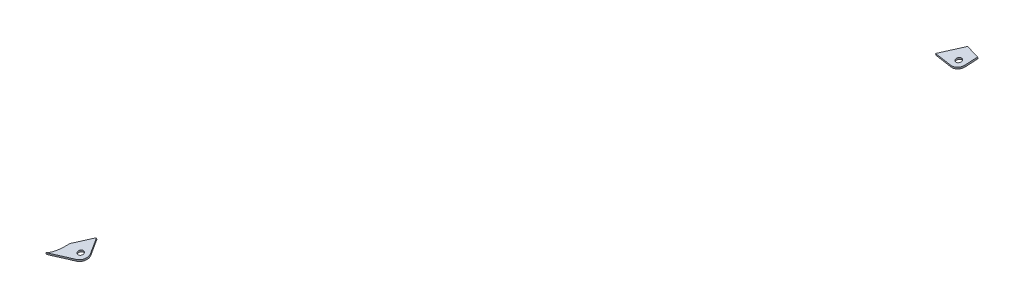
ISO-10303-21;
HEADER;
FILE_DESCRIPTION(('STEP AP214'),'2;1');
FILE_NAME('part.step','',(''),(''),'','','');
FILE_SCHEMA(('AUTOMOTIVE_DESIGN { 1 0 10303 214 1 1 1 1 }'));
ENDSEC;
DATA;
#1=APPLICATION_CONTEXT('core data for automotive mechanical design processes');
#2=APPLICATION_PROTOCOL_DEFINITION('international standard','automotive_design',2000,#1);
#3=PRODUCT_CONTEXT('',#1,'mechanical');
#4=PRODUCT('Part','Part','',(#3));
#5=PRODUCT_RELATED_PRODUCT_CATEGORY('part','',(#4));
#6=PRODUCT_DEFINITION_FORMATION('','',#4);
#7=PRODUCT_DEFINITION_CONTEXT('part definition',#1,'design');
#8=PRODUCT_DEFINITION('design','',#6,#7);
#9=PRODUCT_DEFINITION_SHAPE('','',#8);
#10=(LENGTH_UNIT() NAMED_UNIT(*) SI_UNIT(.MILLI.,.METRE.));
#11=(NAMED_UNIT(*) PLANE_ANGLE_UNIT() SI_UNIT($,.RADIAN.));
#12=(NAMED_UNIT(*) SI_UNIT($,.STERADIAN.) SOLID_ANGLE_UNIT());
#13=UNCERTAINTY_MEASURE_WITH_UNIT(LENGTH_MEASURE(1.E-05),#10,'distance_accuracy_value','');
#14=(GEOMETRIC_REPRESENTATION_CONTEXT(3) GLOBAL_UNCERTAINTY_ASSIGNED_CONTEXT((#13)) GLOBAL_UNIT_ASSIGNED_CONTEXT((#10,
#11,#12)) REPRESENTATION_CONTEXT('',''));
#15=CARTESIAN_POINT('',(0.,0.,0.));
#16=DIRECTION('',(0.,0.,1.));
#17=DIRECTION('',(1.,0.,0.));
#18=AXIS2_PLACEMENT_3D('',#15,#16,#17);
#19=CARTESIAN_POINT('',(1334.80841022403,286.948805486564,488.018057564818));
#20=CARTESIAN_POINT('',(1339.77571566488,288.27052628098,481.218393543914));
#21=CARTESIAN_POINT('',(1344.74018481782,289.591498692983,474.42257961676));
#22=CARTESIAN_POINT('',(1349.70180710941,290.911719908774,467.63063025909));
#23=(BOUNDED_CURVE() B_SPLINE_CURVE(3,(#19,#20,#21,#22),.UNSPECIFIED.,.F.,
.F.) B_SPLINE_CURVE_WITH_KNOTS((4,4),(0.963874291107527,1.),
.UNSPECIFIED.) CURVE() GEOMETRIC_REPRESENTATION_ITEM() RATIONAL_B_SPLINE_CURVE((0.999942294513788,
0.999960808747962,0.999980043910033,1.)) REPRESENTATION_ITEM(''));
#24=DIRECTION('',(0.,-0.981627183447661,-0.190808995376562));
#25=VECTOR('',#24,1.);
#26=SURFACE_OF_LINEAR_EXTRUSION('',#23,#25);
#27=CARTESIAN_POINT('',(1334.80841022403,284.985551119669,487.636439574065));
#28=CARTESIAN_POINT('',(1339.77571566488,286.307271914085,480.836775553161));
#29=CARTESIAN_POINT('',(1344.74018481782,287.628244326087,474.040961626007));
#30=CARTESIAN_POINT('',(1349.70180710941,288.948465541879,467.249012268337));
#31=(BOUNDED_CURVE() B_SPLINE_CURVE(3,(#27,#28,#29,#30),.UNSPECIFIED.,.F.,
.F.) B_SPLINE_CURVE_WITH_KNOTS((4,4),(0.963874291107527,1.),
.UNSPECIFIED.) CURVE() GEOMETRIC_REPRESENTATION_ITEM() RATIONAL_B_SPLINE_CURVE((0.999942294513788,
0.999960808747962,0.999980043910033,1.)) REPRESENTATION_ITEM(''));
#32=CARTESIAN_POINT('',(1334.80841022403,284.985551119669,487.636439574065));
#33=VERTEX_POINT('',#32);
#34=CARTESIAN_POINT('',(1349.70180710889,288.948465541898,467.249012268237));
#35=VERTEX_POINT('',#34);
#36=EDGE_CURVE('E124',#33,#35,#31,.T.);
#37=ORIENTED_EDGE('',*,*,#36,.F.);
#38=DIRECTION('',(0.,-0.981627183447661,-0.190808995376562));
#39=VECTOR('',#38,1.);
#40=CARTESIAN_POINT('',(1334.80841022403,286.948805486564,488.018057564818));
#41=LINE('',#40,#39);
#42=CARTESIAN_POINT('',(1334.80841022403,286.948805486564,488.018057564818));
#43=VERTEX_POINT('',#42);
#44=EDGE_CURVE('E12',#43,#33,#41,.T.);
#45=ORIENTED_EDGE('',*,*,#44,.F.);
#46=CARTESIAN_POINT('',(1349.70180710889,290.911719908794,467.63063025899));
#47=VERTEX_POINT('',#46);
#48=EDGE_CURVE('E117',#43,#47,#23,.T.);
#49=ORIENTED_EDGE('',*,*,#48,.T.);
#50=DIRECTION('',(0.,-0.981627183447661,-0.190808995376562));
#51=VECTOR('',#50,1.);
#52=CARTESIAN_POINT('',(1349.70180710889,290.911719908794,467.63063025899));
#53=LINE('',#52,#51);
#54=EDGE_CURVE('E48',#47,#35,#53,.T.);
#55=ORIENTED_EDGE('',*,*,#54,.T.);
#56=EDGE_LOOP('',(#37,#45,#49,#55));
#57=FACE_BOUND('',#56,.T.);
#58=ADVANCED_FACE('F44',(#57),#26,.T.);
#59=CARTESIAN_POINT('',(1353.96749539418,286.478008377176,490.440098724625));
#60=DIRECTION('',(-0.127728639493142,-0.189246107962099,0.97358682472311));
#61=DIRECTION('',(0.,-0.981627183447662,-0.190808995376555));
#62=AXIS2_PLACEMENT_3D('',#59,#60,#61);
#63=PLANE('',#62);
#64=DIRECTION('',(-0.991809152333871,0.0243717733825484,-0.125381904631246));
#65=VECTOR('',#64,1.);
#66=CARTESIAN_POINT('',(1353.96749539418,284.51475401028,490.058480733872));
#67=LINE('',#66,#65);
#68=CARTESIAN_POINT('',(1353.96749539418,284.51475401028,490.058480733872));
#69=VERTEX_POINT('',#68);
#70=EDGE_CURVE('E144',#69,#33,#67,.T.);
#71=ORIENTED_EDGE('',*,*,#70,.F.);
#72=DIRECTION('',(0.,-0.981627183447661,-0.190808995376562));
#73=VECTOR('',#72,1.);
#74=CARTESIAN_POINT('',(1353.96749539418,286.478008377176,490.440098724625));
#75=LINE('',#74,#73);
#76=CARTESIAN_POINT('',(1353.96749539418,286.478008377176,490.440098724625));
#77=VERTEX_POINT('',#76);
#78=EDGE_CURVE('E54',#77,#69,#75,.T.);
#79=ORIENTED_EDGE('',*,*,#78,.F.);
#80=DIRECTION('',(-0.991809152333871,0.0243717733825484,-0.125381904631246));
#81=VECTOR('',#80,1.);
#82=CARTESIAN_POINT('',(1353.96749539418,286.478008377176,490.440098724625));
#83=LINE('',#82,#81);
#84=EDGE_CURVE('E112',#77,#43,#83,.T.);
#85=ORIENTED_EDGE('',*,*,#84,.T.);
#86=ORIENTED_EDGE('',*,*,#44,.T.);
#87=EDGE_LOOP('',(#71,#79,#85,#86));
#88=FACE_BOUND('',#87,.T.);
#89=ADVANCED_FACE('F150',(#88),#63,.T.);
#90=CARTESIAN_POINT('',(1354.98932451013,287.991977240873,482.651404126841));
#91=DIRECTION('',(0.,-0.981627183447661,-0.190808995376562));
#92=DIRECTION('',(0.,0.190808995376562,-0.981627183447661));
#93=AXIS2_PLACEMENT_3D('',#90,#91,#92);
#94=CYLINDRICAL_SURFACE('',#93,7.99999999999988);
#95=CARTESIAN_POINT('',(1354.98932451013,286.028722873977,482.269786136087));
#96=DIRECTION('',(0.,-0.981627183447661,-0.190808995376562));
#97=DIRECTION('',(0.,0.190808995376562,-0.981627183447661));
#98=AXIS2_PLACEMENT_3D('',#95,#96,#97);
#99=CIRCLE('',#98,7.99999999999988);
#100=CARTESIAN_POINT('',(1362.92379772879,285.833748686907,483.272841373185));
#101=VERTEX_POINT('',#100);
#102=EDGE_CURVE('E101',#101,#69,#99,.T.);
#103=ORIENTED_EDGE('',*,*,#102,.F.);
#104=DIRECTION('',(0.,-0.981627183447661,-0.190808995376562));
#105=VECTOR('',#104,1.);
#106=CARTESIAN_POINT('',(1362.92379772879,287.797003053803,483.654459363938));
#107=LINE('',#106,#105);
#108=CARTESIAN_POINT('',(1362.92379772879,287.797003053803,483.654459363938));
#109=VERTEX_POINT('',#108);
#110=EDGE_CURVE('E96',#109,#101,#107,.T.);
#111=ORIENTED_EDGE('',*,*,#110,.F.);
#112=CARTESIAN_POINT('',(1354.98932451013,287.991977240873,482.651404126841));
#113=DIRECTION('',(0.,-0.981627183447661,-0.190808995376562));
#114=DIRECTION('',(0.,0.190808995376562,-0.981627183447661));
#115=AXIS2_PLACEMENT_3D('',#112,#113,#114);
#116=CIRCLE('',#115,7.99999999999988);
#117=EDGE_CURVE('E99',#109,#77,#116,.T.);
#118=ORIENTED_EDGE('',*,*,#117,.T.);
#119=ORIENTED_EDGE('',*,*,#78,.T.);
#120=EDGE_LOOP('',(#103,#111,#118,#119));
#121=FACE_BOUND('',#120,.T.);
#122=ADVANCED_FACE('F98',(#121),#94,.T.);
#123=CARTESIAN_POINT('',(1362.92379772879,287.797003053803,483.654459363938));
#124=DIRECTION('',(0.991809152333083,-0.0243717733837169,0.12538190463725));
#125=DIRECTION('',(0.125419158615366,0.,-0.992103842675863));
#126=AXIS2_PLACEMENT_3D('',#123,#124,#125);
#127=PLANE('',#126);
#128=DIRECTION('',(-0.12772863949926,-0.189246107961948,0.973586824722337));
#129=VECTOR('',#128,1.);
#130=CARTESIAN_POINT('',(1362.92379772879,285.833748686907,483.272841373185));
#131=LINE('',#130,#129);
#132=CARTESIAN_POINT('',(1364.53800027905,288.22539359362,470.968894963586));
#133=VERTEX_POINT('',#132);
#134=EDGE_CURVE('E138',#133,#101,#131,.T.);
#135=ORIENTED_EDGE('',*,*,#134,.F.);
#136=DIRECTION('',(0.,-0.981627183447661,-0.190808995376562));
#137=VECTOR('',#136,1.);
#138=CARTESIAN_POINT('',(1364.53800027905,290.188647960515,471.350512954339));
#139=LINE('',#138,#137);
#140=CARTESIAN_POINT('',(1364.53800027905,290.188647960515,471.350512954339));
#141=VERTEX_POINT('',#140);
#142=EDGE_CURVE('E106',#141,#133,#139,.T.);
#143=ORIENTED_EDGE('',*,*,#142,.F.);
#144=DIRECTION('',(-0.12772863949926,-0.189246107961948,0.973586824722337));
#145=VECTOR('',#144,1.);
#146=CARTESIAN_POINT('',(1362.92379772879,287.797003053803,483.654459363938));
#147=LINE('',#146,#145);
#148=EDGE_CURVE('E111',#141,#109,#147,.T.);
#149=ORIENTED_EDGE('',*,*,#148,.T.);
#150=ORIENTED_EDGE('',*,*,#110,.T.);
#151=EDGE_LOOP('',(#135,#143,#149,#150));
#152=FACE_BOUND('',#151,.T.);
#153=ADVANCED_FACE('F114',(#152),#127,.T.);
#154=CARTESIAN_POINT('',(1349.70180710889,290.911719908794,467.63063025899));
#155=CARTESIAN_POINT('',(1355.02305477019,290.632243914892,469.06840960578));
#156=CARTESIAN_POINT('',(1359.97623471952,290.391577366024,470.306531666271));
#157=CARTESIAN_POINT('',(1364.53800027905,290.188647960515,471.350512954339));
#158=(BOUNDED_CURVE() B_SPLINE_CURVE(3,(#154,#155,#156,#157),.UNSPECIFIED.,.F.,
.F.) B_SPLINE_CURVE_WITH_KNOTS((4,4),(0.941558542295028,0.993310920669176),
.UNSPECIFIED.) CURVE() GEOMETRIC_REPRESENTATION_ITEM() RATIONAL_B_SPLINE_CURVE((0.88092624518701,
0.911422555321268,0.946038380466901,0.984773720623911)) REPRESENTATION_ITEM(''));
#159=DIRECTION('',(0.,-0.981627183447661,-0.190808995376562));
#160=VECTOR('',#159,1.);
#161=SURFACE_OF_LINEAR_EXTRUSION('',#158,#160);
#162=CARTESIAN_POINT('',(1349.70180710889,288.948465541898,467.249012268237));
#163=CARTESIAN_POINT('',(1355.02305477019,288.668989547997,468.686791615027));
#164=CARTESIAN_POINT('',(1359.97623471952,288.428322999128,469.924913675518));
#165=CARTESIAN_POINT('',(1364.53800027905,288.22539359362,470.968894963586));
#166=(BOUNDED_CURVE() B_SPLINE_CURVE(3,(#162,#163,#164,#165),.UNSPECIFIED.,.F.,
.F.) B_SPLINE_CURVE_WITH_KNOTS((4,4),(0.941558542295028,0.993310920669176),
.UNSPECIFIED.) CURVE() GEOMETRIC_REPRESENTATION_ITEM() RATIONAL_B_SPLINE_CURVE((0.88092624518701,
0.911422555321268,0.946038380466901,0.984773720623911)) REPRESENTATION_ITEM(''));
#167=EDGE_CURVE('E129',#35,#133,#166,.T.);
#168=ORIENTED_EDGE('',*,*,#167,.F.);
#169=ORIENTED_EDGE('',*,*,#54,.F.);
#170=EDGE_CURVE('E115',#47,#141,#158,.T.);
#171=ORIENTED_EDGE('',*,*,#170,.T.);
#172=ORIENTED_EDGE('',*,*,#142,.T.);
#173=EDGE_LOOP('',(#168,#169,#171,#172));
#174=FACE_BOUND('',#173,.T.);
#175=ADVANCED_FACE('F147',(#174),#161,.T.);
#176=CARTESIAN_POINT('',(1342.25731146865,288.930844096941,477.821352871996));
#177=DIRECTION('',(7.54046279953524E-09,-0.981627184479453,-0.190808990068451));
#178=DIRECTION('',(0.,0.190808990068451,-0.981627184479453));
#179=AXIS2_PLACEMENT_3D('',#176,#177,#178);
#180=PLANE('',#179);
#181=CARTESIAN_POINT('',(1354.98932451013,287.991977240873,482.651404126841));
#182=DIRECTION('',(0.,-0.981627183447661,-0.190808995376562));
#183=DIRECTION('',(0.,0.190808995376562,-0.981627183447661));
#184=AXIS2_PLACEMENT_3D('',#181,#182,#183);
#185=CIRCLE('',#184,2.99999999999994);
#186=CARTESIAN_POINT('',(1354.98932451013,288.564404227002,479.706522576498));
#187=VERTEX_POINT('',#186);
#188=EDGE_CURVE('E130',#187,#187,#185,.T.);
#189=ORIENTED_EDGE('',*,*,#188,.T.);
#190=EDGE_LOOP('',(#189));
#191=FACE_BOUND('',#190,.T.);
#192=ORIENTED_EDGE('',*,*,#48,.F.);
#193=ORIENTED_EDGE('',*,*,#84,.F.);
#194=ORIENTED_EDGE('',*,*,#117,.F.);
#195=ORIENTED_EDGE('',*,*,#148,.F.);
#196=ORIENTED_EDGE('',*,*,#170,.F.);
#197=EDGE_LOOP('',(#192,#193,#194,#195,#196));
#198=FACE_BOUND('',#197,.T.);
#199=ADVANCED_FACE('F110',(#191,#198),#180,.F.);
#200=CARTESIAN_POINT('',(1342.25731146865,286.967589730046,477.439734881243));
#201=DIRECTION('',(7.54046279953524E-09,-0.981627184479453,-0.190808990068451));
#202=DIRECTION('',(0.,0.190808990068451,-0.981627184479453));
#203=AXIS2_PLACEMENT_3D('',#200,#201,#202);
#204=PLANE('',#203);
#205=CARTESIAN_POINT('',(1354.98932451013,286.028722873977,482.269786136087));
#206=DIRECTION('',(0.,-0.981627183447661,-0.190808995376562));
#207=DIRECTION('',(0.,0.190808995376562,-0.981627183447661));
#208=AXIS2_PLACEMENT_3D('',#205,#206,#207);
#209=CIRCLE('',#208,2.99999999999994);
#210=CARTESIAN_POINT('',(1354.98932451013,286.601149860107,479.324904585744));
#211=VERTEX_POINT('',#210);
#212=EDGE_CURVE('E182',#211,#211,#209,.T.);
#213=ORIENTED_EDGE('',*,*,#212,.F.);
#214=EDGE_LOOP('',(#213));
#215=FACE_BOUND('',#214,.T.);
#216=ORIENTED_EDGE('',*,*,#36,.T.);
#217=ORIENTED_EDGE('',*,*,#167,.T.);
#218=ORIENTED_EDGE('',*,*,#134,.T.);
#219=ORIENTED_EDGE('',*,*,#102,.T.);
#220=ORIENTED_EDGE('',*,*,#70,.T.);
#221=EDGE_LOOP('',(#216,#217,#218,#219,#220));
#222=FACE_BOUND('',#221,.T.);
#223=ADVANCED_FACE('F149',(#215,#222),#204,.T.);
#224=CARTESIAN_POINT('',(1354.98932451013,287.991977240873,482.651404126841));
#225=DIRECTION('',(0.,-0.981627183447661,-0.190808995376562));
#226=DIRECTION('',(0.,0.190808995376562,-0.981627183447661));
#227=AXIS2_PLACEMENT_3D('',#224,#225,#226);
#228=CYLINDRICAL_SURFACE('',#227,2.99999999999994);
#229=ORIENTED_EDGE('',*,*,#188,.F.);
#230=EDGE_LOOP('',(#229));
#231=FACE_BOUND('',#230,.T.);
#232=ORIENTED_EDGE('',*,*,#212,.T.);
#233=EDGE_LOOP('',(#232));
#234=FACE_BOUND('',#233,.T.);
#235=ADVANCED_FACE('F170',(#231,#234),#228,.F.);
#236=CLOSED_SHELL('',(#58,#89,#122,#153,#175,#199,#223,#235));
#237=MANIFOLD_SOLID_BREP('B2',#236);
#238=CARTESIAN_POINT('',(923.569906868332,176.143738161114,1058.06071166388));
#239=CARTESIAN_POINT('',(923.978106770845,176.194725851389,1057.79840273711));
#240=CARTESIAN_POINT('',(924.361430621937,176.25237635367,1057.50181661408));
#241=CARTESIAN_POINT('',(924.933250586607,176.351512786669,1056.99180387957));
#242=CARTESIAN_POINT('',(925.135186128114,176.389480944466,1056.79647464089));
#243=CARTESIAN_POINT('',(925.521222500008,176.467380182454,1056.39571780326));
#244=CARTESIAN_POINT('',(925.706214443309,176.507458436446,1056.18953306073));
#245=CARTESIAN_POINT('',(926.596451968125,176.71273227506,1055.13349070992));
#246=CARTESIAN_POINT('',(927.201304914618,176.892533494042,1054.20849362673));
#247=CARTESIAN_POINT('',(928.265984348611,177.270510413532,1052.26397094762));
#248=CARTESIAN_POINT('',(928.714956528832,177.465090877904,1051.2629412382));
#249=CARTESIAN_POINT('',(929.501728033637,177.861708895427,1049.22251842335));
#250=CARTESIAN_POINT('',(929.83867607656,178.063803549593,1048.18283155865));
#251=CARTESIAN_POINT('',(930.429066466174,178.473594129809,1046.0746417835));
#252=CARTESIAN_POINT('',(930.682852112076,178.681957629435,1045.00270450472));
#253=CARTESIAN_POINT('',(931.173926629931,179.149466366922,1042.59758055177));
#254=CARTESIAN_POINT('',(931.393872962749,179.408729419647,1041.26378777269));
#255=CARTESIAN_POINT('',(931.575131617797,179.668330600665,1039.92825547433));
#256=B_SPLINE_CURVE_WITH_KNOTS('',3,(#238,#239,#240,#241,#242,#243,#244,#245,#246,#247,#248,
#249,#250,#251,#252,#253,#254,#255),.UNSPECIFIED.,.F.,.F.,(4,2,2,2,2,2,2,2,4),
(0.533256834167614,0.546875000000102,0.554687500000106,0.562500000000109,0.593750000000104,
0.625000000000098,0.656250000000093,0.687500000000087,0.726253317925459),.UNSPECIFIED.);
#257=DIRECTION('',(0.,-0.981627183447661,-0.190808995376562));
#258=VECTOR('',#257,1.);
#259=SURFACE_OF_LINEAR_EXTRUSION('',#256,#258);
#260=CARTESIAN_POINT('',(931.575131617797,177.70507623377,1039.54663748358));
#261=CARTESIAN_POINT('',(931.393872962749,177.445475052751,1040.88216978193));
#262=CARTESIAN_POINT('',(931.173926629931,177.186212000027,1042.21596256102));
#263=CARTESIAN_POINT('',(930.682852112076,176.718703262539,1044.62108651396));
#264=CARTESIAN_POINT('',(930.429066466174,176.510339762913,1045.69302379275));
#265=CARTESIAN_POINT('',(929.838676076559,176.100549182698,1047.8012135679));
#266=CARTESIAN_POINT('',(929.501728033637,175.898454528531,1048.8409004326));
#267=CARTESIAN_POINT('',(928.714956528832,175.501836511008,1050.88132324745));
#268=CARTESIAN_POINT('',(928.265984348611,175.307256046637,1051.88235295686));
#269=CARTESIAN_POINT('',(927.201304914618,174.929279127146,1053.82687563597));
#270=CARTESIAN_POINT('',(926.596451968125,174.749477908164,1054.75187271916));
#271=CARTESIAN_POINT('',(925.706214443309,174.54420406955,1055.80791506998));
#272=CARTESIAN_POINT('',(925.521222500008,174.504125815558,1056.01409981251));
#273=CARTESIAN_POINT('',(925.135186128113,174.42622657757,1056.41485665014));
#274=CARTESIAN_POINT('',(924.933250586607,174.388258419773,1056.61018588881));
#275=CARTESIAN_POINT('',(924.361430621937,174.289121986774,1057.12019862333));
#276=CARTESIAN_POINT('',(923.978106770845,174.231471484494,1057.41678474636));
#277=CARTESIAN_POINT('',(923.569906868332,174.180483794219,1057.67909367312));
#278=B_SPLINE_CURVE_WITH_KNOTS('',3,(#260,#261,#262,#263,#264,#265,#266,#267,#268,#269,#270,
#271,#272,#273,#274,#275,#276,#277),.UNSPECIFIED.,.F.,.F.,(4,2,2,2,2,2,2,2,4),
(0.533256834167614,0.572010152092986,0.60326015209298,0.634510152092975,0.665760152092969,
0.697010152092964,0.704822652092967,0.712635152092971,0.726253317925459),.UNSPECIFIED.);
#279=CARTESIAN_POINT('',(923.569906868331,174.180483794219,1057.67909367312));
#280=VERTEX_POINT('',#279);
#281=CARTESIAN_POINT('',(931.575131617797,177.70507623377,1039.54663748358));
#282=VERTEX_POINT('',#281);
#283=EDGE_CURVE('E372',#280,#282,#278,.F.);
#284=ORIENTED_EDGE('',*,*,#283,.F.);
#285=DIRECTION('',(0.,-0.981627183447661,-0.190808995376562));
#286=VECTOR('',#285,1.);
#287=CARTESIAN_POINT('',(923.569906868332,176.143738161114,1058.06071166388));
#288=LINE('',#287,#286);
#289=CARTESIAN_POINT('',(923.569906868332,176.143738161114,1058.06071166388));
#290=VERTEX_POINT('',#289);
#291=EDGE_CURVE('E42',#290,#280,#288,.T.);
#292=ORIENTED_EDGE('',*,*,#291,.F.);
#293=CARTESIAN_POINT('',(923.569906868332,176.143738161114,1058.06071166388));
#294=CARTESIAN_POINT('',(923.978106770845,176.194725851389,1057.79840273711));
#295=CARTESIAN_POINT('',(924.361430621937,176.25237635367,1057.50181661408));
#296=CARTESIAN_POINT('',(924.933250586607,176.351512786669,1056.99180387957));
#297=CARTESIAN_POINT('',(925.135186128114,176.389480944466,1056.79647464089));
#298=CARTESIAN_POINT('',(925.521222500008,176.467380182454,1056.39571780326));
#299=CARTESIAN_POINT('',(925.706214443309,176.507458436446,1056.18953306073));
#300=CARTESIAN_POINT('',(926.596451968125,176.71273227506,1055.13349070992));
#301=CARTESIAN_POINT('',(927.201304914618,176.892533494042,1054.20849362673));
#302=CARTESIAN_POINT('',(928.265984348611,177.270510413532,1052.26397094762));
#303=CARTESIAN_POINT('',(928.714956528832,177.465090877904,1051.2629412382));
#304=CARTESIAN_POINT('',(929.501728033637,177.861708895427,1049.22251842335));
#305=CARTESIAN_POINT('',(929.83867607656,178.063803549593,1048.18283155865));
#306=CARTESIAN_POINT('',(930.429066466174,178.473594129809,1046.0746417835));
#307=CARTESIAN_POINT('',(930.682852112076,178.681957629435,1045.00270450472));
#308=CARTESIAN_POINT('',(931.173926629931,179.149466366922,1042.59758055177));
#309=CARTESIAN_POINT('',(931.393872962749,179.408729419647,1041.26378777269));
#310=CARTESIAN_POINT('',(931.575131617797,179.668330600665,1039.92825547433));
#311=B_SPLINE_CURVE_WITH_KNOTS('',3,(#293,#294,#295,#296,#297,#298,#299,#300,#301,#302,#303,
#304,#305,#306,#307,#308,#309,#310),.UNSPECIFIED.,.F.,.F.,(4,2,2,2,2,2,2,2,4),
(0.533256834167614,0.546875000000102,0.554687500000106,0.562500000000109,0.593750000000104,
0.625000000000098,0.656250000000093,0.687500000000087,0.726253317925459),.UNSPECIFIED.);
#312=CARTESIAN_POINT('',(931.575131617797,179.668330600665,1039.92825547433));
#313=VERTEX_POINT('',#312);
#314=EDGE_CURVE('E313',#290,#313,#311,.T.);
#315=ORIENTED_EDGE('',*,*,#314,.T.);
#316=DIRECTION('',(0.,-0.981627183447661,-0.190808995376562));
#317=VECTOR('',#316,1.);
#318=CARTESIAN_POINT('',(931.575131617797,179.668330600665,1039.92825547433));
#319=LINE('',#318,#317);
#320=EDGE_CURVE('E287',#313,#282,#319,.T.);
#321=ORIENTED_EDGE('',*,*,#320,.T.);
#322=EDGE_LOOP('',(#284,#292,#315,#321));
#323=FACE_BOUND('',#322,.T.);
#324=ADVANCED_FACE('F236',(#323),#259,.T.);
#325=CARTESIAN_POINT('',(948.510924792447,177.8079708982,1049.49897645279));
#326=DIRECTION('',(0.330101796520686,-0.180113261917371,0.926602404926352));
#327=DIRECTION('',(0.942008120863403,0.,-0.335590077665297));
#328=AXIS2_PLACEMENT_3D('',#325,#326,#327);
#329=PLANE('',#328);
#330=DIRECTION('',(-0.943945339484133,-0.0629863921660654,0.324036896769623));
#331=VECTOR('',#330,1.);
#332=CARTESIAN_POINT('',(948.510924792447,175.844716531305,1049.11735846203));
#333=LINE('',#332,#331);
#334=CARTESIAN_POINT('',(948.510924792447,175.844716531305,1049.11735846203));
#335=VERTEX_POINT('',#334);
#336=EDGE_CURVE('E324',#335,#280,#333,.T.);
#337=ORIENTED_EDGE('',*,*,#336,.F.);
#338=DIRECTION('',(0.,-0.981627183447661,-0.190808995376562));
#339=VECTOR('',#338,1.);
#340=CARTESIAN_POINT('',(948.510924792447,177.8079708982,1049.49897645279));
#341=LINE('',#340,#339);
#342=CARTESIAN_POINT('',(948.510924792447,177.8079708982,1049.49897645279));
#343=VERTEX_POINT('',#342);
#344=EDGE_CURVE('E249',#343,#335,#341,.T.);
#345=ORIENTED_EDGE('',*,*,#344,.F.);
#346=DIRECTION('',(-0.943945339484133,-0.0629863921660654,0.324036896769623));
#347=VECTOR('',#346,1.);
#348=CARTESIAN_POINT('',(948.510924792447,177.8079708982,1049.49897645279));
#349=LINE('',#348,#347);
#350=EDGE_CURVE('E308',#343,#290,#349,.T.);
#351=ORIENTED_EDGE('',*,*,#350,.T.);
#352=ORIENTED_EDGE('',*,*,#291,.T.);
#353=EDGE_LOOP('',(#337,#345,#351,#352));
#354=FACE_BOUND('',#353,.T.);
#355=ADVANCED_FACE('F358',(#354),#329,.T.);
#356=CARTESIAN_POINT('',(945.870110420281,179.248876993539,1042.08615721338));
#357=DIRECTION('',(0.,-0.981627183447661,-0.190808995376562));
#358=DIRECTION('',(0.,0.190808995376562,-0.981627183447661));
#359=AXIS2_PLACEMENT_3D('',#356,#357,#358);
#360=CYLINDRICAL_SURFACE('',#359,7.9999999999999);
#361=CARTESIAN_POINT('',(945.870110420281,177.285622626644,1041.70453922262));
#362=DIRECTION('',(0.,-0.981627183447661,-0.190808995376562));
#363=DIRECTION('',(0.,0.190808995376562,-0.981627183447661));
#364=AXIS2_PLACEMENT_3D('',#361,#362,#363);
#365=CIRCLE('',#364,7.9999999999999);
#366=CARTESIAN_POINT('',(952.848375326948,178.032069243004,1037.86440428472));
#367=VERTEX_POINT('',#366);
#368=EDGE_CURVE('E297',#367,#335,#365,.T.);
#369=ORIENTED_EDGE('',*,*,#368,.F.);
#370=DIRECTION('',(0.,-0.981627183447661,-0.190808995376562));
#371=VECTOR('',#370,1.);
#372=CARTESIAN_POINT('',(952.848375326948,179.995323609899,1038.24602227547));
#373=LINE('',#372,#371);
#374=CARTESIAN_POINT('',(952.848375326948,179.995323609899,1038.24602227547));
#375=VERTEX_POINT('',#374);
#376=EDGE_CURVE('E292',#375,#367,#373,.T.);
#377=ORIENTED_EDGE('',*,*,#376,.F.);
#378=CARTESIAN_POINT('',(945.870110420281,179.248876993539,1042.08615721338));
#379=DIRECTION('',(0.,-0.981627183447661,-0.190808995376562));
#380=DIRECTION('',(0.,0.190808995376562,-0.981627183447661));
#381=AXIS2_PLACEMENT_3D('',#378,#379,#380);
#382=CIRCLE('',#381,7.9999999999999);
#383=EDGE_CURVE('E295',#375,#343,#382,.T.);
#384=ORIENTED_EDGE('',*,*,#383,.T.);
#385=ORIENTED_EDGE('',*,*,#344,.T.);
#386=EDGE_LOOP('',(#369,#377,#384,#385));
#387=FACE_BOUND('',#386,.T.);
#388=ADVANCED_FACE('F294',(#387),#360,.T.);
#389=CARTESIAN_POINT('',(952.848375326948,179.995323609899,1038.24602227547));
#390=DIRECTION('',(0.872283113333319,0.0933058270450055,-0.480016867237997));
#391=DIRECTION('',(-0.482120118377002,0.,-0.876105125801776));
#392=AXIS2_PLACEMENT_3D('',#389,#390,#391);
#393=PLANE('',#392);
#394=DIRECTION('',(0.489001196515441,-0.166439464539093,0.856256815710338));
#395=VECTOR('',#394,1.);
#396=CARTESIAN_POINT('',(952.848375326948,178.032069243004,1037.86440428472));
#397=LINE('',#396,#395);
#398=CARTESIAN_POINT('',(944.055127391948,181.0249933673,1022.46714446158));
#399=VERTEX_POINT('',#398);
#400=EDGE_CURVE('E320',#399,#367,#397,.T.);
#401=ORIENTED_EDGE('',*,*,#400,.F.);
#402=DIRECTION('',(0.,-0.981627183447661,-0.190808995376562));
#403=VECTOR('',#402,1.);
#404=CARTESIAN_POINT('',(944.055127391949,182.988247734196,1022.84876245233));
#405=LINE('',#404,#403);
#406=CARTESIAN_POINT('',(944.055127391949,182.988247734196,1022.84876245233));
#407=VERTEX_POINT('',#406);
#408=EDGE_CURVE('E302',#407,#399,#405,.T.);
#409=ORIENTED_EDGE('',*,*,#408,.F.);
#410=DIRECTION('',(0.489001196515441,-0.166439464539093,0.856256815710338));
#411=VECTOR('',#410,1.);
#412=CARTESIAN_POINT('',(952.848375326948,179.995323609899,1038.24602227547));
#413=LINE('',#412,#411);
#414=EDGE_CURVE('E307',#407,#375,#413,.T.);
#415=ORIENTED_EDGE('',*,*,#414,.T.);
#416=ORIENTED_EDGE('',*,*,#376,.T.);
#417=EDGE_LOOP('',(#401,#409,#415,#416));
#418=FACE_BOUND('',#417,.T.);
#419=ADVANCED_FACE('F310',(#418),#393,.T.);
#420=CARTESIAN_POINT('',(931.575131617797,179.668330600665,1039.92825547433));
#421=CARTESIAN_POINT('',(935.736568160242,180.775348076133,1034.23314427516));
#422=CARTESIAN_POINT('',(939.896568770959,181.881987657761,1028.53997717126));
#423=CARTESIAN_POINT('',(944.055127391949,182.988247734196,1022.84876245233));
#424=(BOUNDED_CURVE() B_SPLINE_CURVE(3,(#420,#421,#422,#423),.UNSPECIFIED.,.F.,
.F.) B_SPLINE_CURVE_WITH_KNOTS((4,4),(0.,0.0294757023408717),
.UNSPECIFIED.) CURVE() GEOMETRIC_REPRESENTATION_ITEM() RATIONAL_B_SPLINE_CURVE((1.,
0.999983717419373,0.999967914779245,0.999952592079617)) REPRESENTATION_ITEM(''));
#425=DIRECTION('',(0.,-0.981627183447661,-0.190808995376562));
#426=VECTOR('',#425,1.);
#427=SURFACE_OF_LINEAR_EXTRUSION('',#424,#426);
#428=CARTESIAN_POINT('',(931.575131617797,177.70507623377,1039.54663748358));
#429=CARTESIAN_POINT('',(935.736568160242,178.812093709237,1033.85152628441));
#430=CARTESIAN_POINT('',(939.896568770959,179.918733290866,1028.15835918051));
#431=CARTESIAN_POINT('',(944.055127391948,181.0249933673,1022.46714446158));
#432=(BOUNDED_CURVE() B_SPLINE_CURVE(3,(#428,#429,#430,#431),.UNSPECIFIED.,.F.,
.F.) B_SPLINE_CURVE_WITH_KNOTS((4,4),(0.,0.0294757023408717),
.UNSPECIFIED.) CURVE() GEOMETRIC_REPRESENTATION_ITEM() RATIONAL_B_SPLINE_CURVE((1.,
0.999983717419373,0.999967914779245,0.999952592079617)) REPRESENTATION_ITEM(''));
#433=EDGE_CURVE('E322',#282,#399,#432,.T.);
#434=ORIENTED_EDGE('',*,*,#433,.F.);
#435=ORIENTED_EDGE('',*,*,#320,.F.);
#436=EDGE_CURVE('E311',#313,#407,#424,.T.);
#437=ORIENTED_EDGE('',*,*,#436,.T.);
#438=ORIENTED_EDGE('',*,*,#408,.T.);
#439=EDGE_LOOP('',(#434,#435,#437,#438));
#440=FACE_BOUND('',#439,.T.);
#441=ADVANCED_FACE('F351',(#440),#427,.T.);
#442=CARTESIAN_POINT('',(929.284049441677,177.754184912222,1049.77568136296));
#443=DIRECTION('',(1.78421516544111E-13,-0.981627183447715,-0.190808995376283));
#444=DIRECTION('',(0.,0.190808995376283,-0.981627183447715));
#445=AXIS2_PLACEMENT_3D('',#442,#443,#444);
#446=PLANE('',#445);
#447=CARTESIAN_POINT('',(945.870110420281,179.248876993539,1042.08615721338));
#448=DIRECTION('',(0.,-0.981627183447661,-0.190808995376562));
#449=DIRECTION('',(0.,0.190808995376562,-0.981627183447661));
#450=AXIS2_PLACEMENT_3D('',#447,#448,#449);
#451=CIRCLE('',#450,2.99999999999994);
#452=CARTESIAN_POINT('',(945.870110420281,179.821303979669,1039.14127566303));
#453=VERTEX_POINT('',#452);
#454=EDGE_CURVE('E386',#453,#453,#451,.T.);
#455=ORIENTED_EDGE('',*,*,#454,.T.);
#456=EDGE_LOOP('',(#455));
#457=FACE_BOUND('',#456,.T.);
#458=ORIENTED_EDGE('',*,*,#314,.F.);
#459=ORIENTED_EDGE('',*,*,#350,.F.);
#460=ORIENTED_EDGE('',*,*,#383,.F.);
#461=ORIENTED_EDGE('',*,*,#414,.F.);
#462=ORIENTED_EDGE('',*,*,#436,.F.);
#463=EDGE_LOOP('',(#458,#459,#460,#461,#462));
#464=FACE_BOUND('',#463,.T.);
#465=ADVANCED_FACE('F306',(#457,#464),#446,.F.);
#466=CARTESIAN_POINT('',(929.284049441677,175.790930545327,1049.3940633722));
#467=DIRECTION('',(1.78421516544111E-13,-0.981627183447715,-0.190808995376283));
#468=DIRECTION('',(0.,0.190808995376283,-0.981627183447715));
#469=AXIS2_PLACEMENT_3D('',#466,#467,#468);
#470=PLANE('',#469);
#471=CARTESIAN_POINT('',(945.870110420281,177.285622626644,1041.70453922262));
#472=DIRECTION('',(0.,-0.981627183447661,-0.190808995376562));
#473=DIRECTION('',(0.,0.190808995376562,-0.981627183447661));
#474=AXIS2_PLACEMENT_3D('',#471,#472,#473);
#475=CIRCLE('',#474,2.99999999999994);
#476=CARTESIAN_POINT('',(945.870110420281,177.858049612774,1038.75965767228));
#477=VERTEX_POINT('',#476);
#478=EDGE_CURVE('E388',#477,#477,#475,.T.);
#479=ORIENTED_EDGE('',*,*,#478,.F.);
#480=EDGE_LOOP('',(#479));
#481=FACE_BOUND('',#480,.T.);
#482=ORIENTED_EDGE('',*,*,#283,.T.);
#483=ORIENTED_EDGE('',*,*,#433,.T.);
#484=ORIENTED_EDGE('',*,*,#400,.T.);
#485=ORIENTED_EDGE('',*,*,#368,.T.);
#486=ORIENTED_EDGE('',*,*,#336,.T.);
#487=EDGE_LOOP('',(#482,#483,#484,#485,#486));
#488=FACE_BOUND('',#487,.T.);
#489=ADVANCED_FACE('F350',(#481,#488),#470,.T.);
#490=CARTESIAN_POINT('',(945.870110420281,179.248876993539,1042.08615721338));
#491=DIRECTION('',(0.,-0.981627183447661,-0.190808995376562));
#492=DIRECTION('',(0.,0.190808995376562,-0.981627183447661));
#493=AXIS2_PLACEMENT_3D('',#490,#491,#492);
#494=CYLINDRICAL_SURFACE('',#493,2.99999999999994);
#495=ORIENTED_EDGE('',*,*,#454,.F.);
#496=EDGE_LOOP('',(#495));
#497=FACE_BOUND('',#496,.T.);
#498=ORIENTED_EDGE('',*,*,#478,.T.);
#499=EDGE_LOOP('',(#498));
#500=FACE_BOUND('',#499,.T.);
#501=ADVANCED_FACE('F353',(#497,#500),#494,.F.);
#502=CLOSED_SHELL('',(#324,#355,#388,#419,#441,#465,#489,#501));
#503=MANIFOLD_SOLID_BREP('B6',#502);
#504=ADVANCED_BREP_SHAPE_REPRESENTATION('',(#18,#237,#503),#14);
#505=SHAPE_DEFINITION_REPRESENTATION(#9,#504);
ENDSEC;
END-ISO-10303-21;
